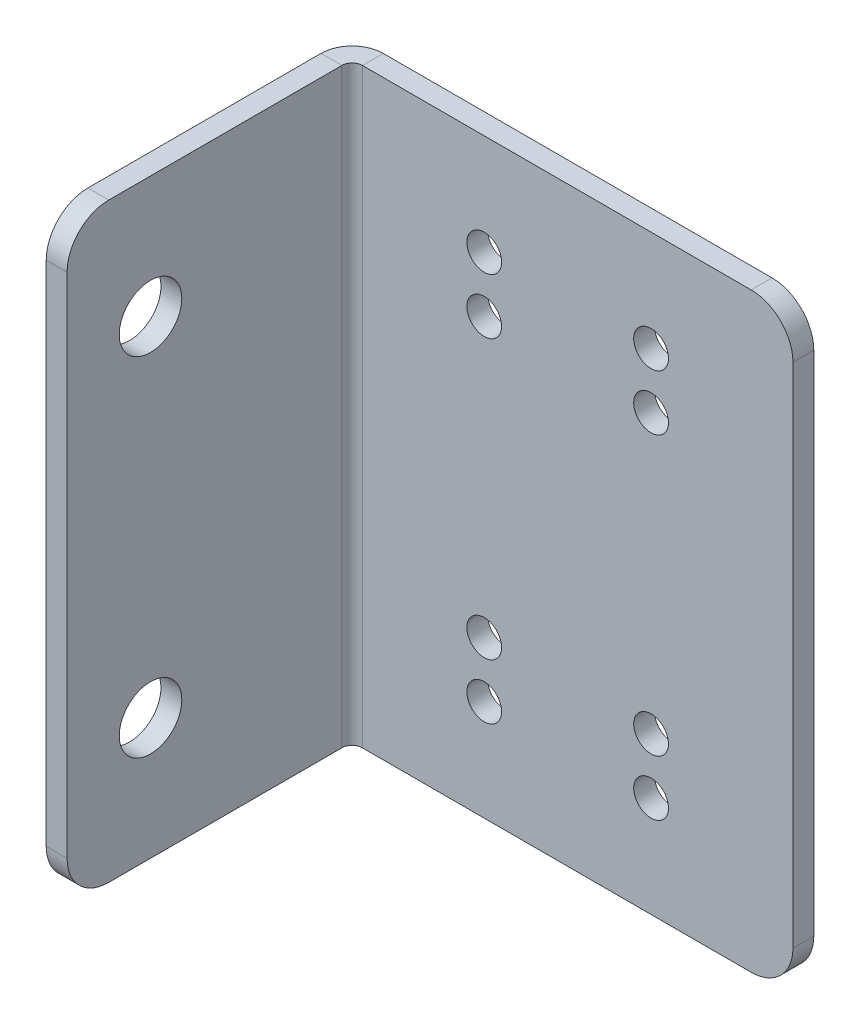
ISO-10303-21;
HEADER;
FILE_DESCRIPTION(('STEP AP214'),'2;1');
FILE_NAME('part.step','',(''),(''),'','','');
FILE_SCHEMA(('AUTOMOTIVE_DESIGN { 1 0 10303 214 1 1 1 1 }'));
ENDSEC;
DATA;
#1=APPLICATION_CONTEXT('core data for automotive mechanical design processes');
#2=APPLICATION_PROTOCOL_DEFINITION('international standard','automotive_design',2000,#1);
#3=PRODUCT_CONTEXT('',#1,'mechanical');
#4=PRODUCT('Part','Part','',(#3));
#5=PRODUCT_RELATED_PRODUCT_CATEGORY('part','',(#4));
#6=PRODUCT_DEFINITION_FORMATION('','',#4);
#7=PRODUCT_DEFINITION_CONTEXT('part definition',#1,'design');
#8=PRODUCT_DEFINITION('design','',#6,#7);
#9=PRODUCT_DEFINITION_SHAPE('','',#8);
#10=(LENGTH_UNIT() NAMED_UNIT(*) SI_UNIT(.MILLI.,.METRE.));
#11=(NAMED_UNIT(*) PLANE_ANGLE_UNIT() SI_UNIT($,.RADIAN.));
#12=(NAMED_UNIT(*) SI_UNIT($,.STERADIAN.) SOLID_ANGLE_UNIT());
#13=UNCERTAINTY_MEASURE_WITH_UNIT(LENGTH_MEASURE(1.E-05),#10,'distance_accuracy_value','');
#14=(GEOMETRIC_REPRESENTATION_CONTEXT(3) GLOBAL_UNCERTAINTY_ASSIGNED_CONTEXT((#13)) GLOBAL_UNIT_ASSIGNED_CONTEXT((#10,
#11,#12)) REPRESENTATION_CONTEXT('',''));
#15=CARTESIAN_POINT('',(0.,0.,0.));
#16=DIRECTION('',(0.,0.,1.));
#17=DIRECTION('',(1.,0.,0.));
#18=AXIS2_PLACEMENT_3D('',#15,#16,#17);
#19=CARTESIAN_POINT('',(16.6,-21.25,-1.5));
#20=DIRECTION('',(0.,-1.,0.));
#21=DIRECTION('',(1.,0.,0.));
#22=AXIS2_PLACEMENT_3D('',#19,#20,#21);
#23=PLANE('',#22);
#24=DIRECTION('',(1.,0.,0.));
#25=VECTOR('',#24,1.);
#26=CARTESIAN_POINT('',(16.6,-21.25,-1.5));
#27=LINE('',#26,#25);
#28=CARTESIAN_POINT('',(-14.3634,-21.25,-1.5));
#29=VERTEX_POINT('',#28);
#30=CARTESIAN_POINT('',(13.6,-21.25,-1.5));
#31=VERTEX_POINT('',#30);
#32=EDGE_CURVE('E219',#29,#31,#27,.T.);
#33=ORIENTED_EDGE('',*,*,#32,.T.);
#34=DIRECTION('',(0.,0.,1.));
#35=VECTOR('',#34,1.);
#36=CARTESIAN_POINT('',(13.6,-21.25,-1.5));
#37=LINE('',#36,#35);
#38=CARTESIAN_POINT('',(13.6,-21.25,0.));
#39=VERTEX_POINT('',#38);
#40=EDGE_CURVE('E247',#31,#39,#37,.T.);
#41=ORIENTED_EDGE('',*,*,#40,.T.);
#42=DIRECTION('',(1.,0.,0.));
#43=VECTOR('',#42,1.);
#44=CARTESIAN_POINT('',(16.6,-21.25,0.));
#45=LINE('',#44,#43);
#46=CARTESIAN_POINT('',(-14.3634,-21.25,0.));
#47=VERTEX_POINT('',#46);
#48=EDGE_CURVE('E216',#47,#39,#45,.T.);
#49=ORIENTED_EDGE('',*,*,#48,.F.);
#50=DIRECTION('',(0.,0.,-1.));
#51=VECTOR('',#50,1.);
#52=CARTESIAN_POINT('',(-14.3634,-21.25,0.));
#53=LINE('',#52,#51);
#54=EDGE_CURVE('E205',#47,#29,#53,.T.);
#55=ORIENTED_EDGE('',*,*,#54,.T.);
#56=EDGE_LOOP('',(#33,#41,#49,#55));
#57=FACE_BOUND('',#56,.T.);
#58=ADVANCED_FACE('F58',(#57),#23,.T.);
#59=CARTESIAN_POINT('',(0.,0.,-1.5));
#60=DIRECTION('',(0.,0.,1.));
#61=DIRECTION('',(1.,0.,0.));
#62=AXIS2_PLACEMENT_3D('',#59,#60,#61);
#63=PLANE('',#62);
#64=CARTESIAN_POINT('',(-5.59999999999984,-14.,-1.5));
#65=DIRECTION('',(0.,0.,1.));
#66=DIRECTION('',(1.,0.,0.));
#67=AXIS2_PLACEMENT_3D('',#64,#65,#66);
#68=CIRCLE('',#67,1.25);
#69=CARTESIAN_POINT('',(-4.34999999999984,-14.,-1.5));
#70=VERTEX_POINT('',#69);
#71=EDGE_CURVE('E645',#70,#70,#68,.F.);
#72=ORIENTED_EDGE('',*,*,#71,.F.);
#73=EDGE_LOOP('',(#72));
#74=FACE_BOUND('',#73,.T.);
#75=CARTESIAN_POINT('',(6.40000000000016,10.,-1.5));
#76=DIRECTION('',(0.,0.,1.));
#77=DIRECTION('',(1.,0.,0.));
#78=AXIS2_PLACEMENT_3D('',#75,#76,#77);
#79=CIRCLE('',#78,1.25);
#80=CARTESIAN_POINT('',(7.65000000000016,10.,-1.5));
#81=VERTEX_POINT('',#80);
#82=EDGE_CURVE('E650',#81,#81,#79,.F.);
#83=ORIENTED_EDGE('',*,*,#82,.F.);
#84=EDGE_LOOP('',(#83));
#85=FACE_BOUND('',#84,.T.);
#86=CARTESIAN_POINT('',(-5.59999999999985,10.,-1.5));
#87=DIRECTION('',(0.,0.,1.));
#88=DIRECTION('',(1.,0.,0.));
#89=AXIS2_PLACEMENT_3D('',#86,#87,#88);
#90=CIRCLE('',#89,1.25);
#91=CARTESIAN_POINT('',(-4.34999999999984,10.,-1.5));
#92=VERTEX_POINT('',#91);
#93=EDGE_CURVE('E653',#92,#92,#90,.F.);
#94=ORIENTED_EDGE('',*,*,#93,.F.);
#95=EDGE_LOOP('',(#94));
#96=FACE_BOUND('',#95,.T.);
#97=CARTESIAN_POINT('',(6.40000000000016,-14.,-1.5));
#98=DIRECTION('',(0.,0.,1.));
#99=DIRECTION('',(1.,0.,0.));
#100=AXIS2_PLACEMENT_3D('',#97,#98,#99);
#101=CIRCLE('',#100,1.25);
#102=CARTESIAN_POINT('',(7.65000000000016,-14.,-1.5));
#103=VERTEX_POINT('',#102);
#104=EDGE_CURVE('E656',#103,#103,#101,.F.);
#105=ORIENTED_EDGE('',*,*,#104,.F.);
#106=EDGE_LOOP('',(#105));
#107=FACE_BOUND('',#106,.T.);
#108=CARTESIAN_POINT('',(-5.59999999999984,14.,-1.5));
#109=DIRECTION('',(0.,0.,1.));
#110=DIRECTION('',(1.,0.,0.));
#111=AXIS2_PLACEMENT_3D('',#108,#109,#110);
#112=CIRCLE('',#111,1.25);
#113=CARTESIAN_POINT('',(-4.34999999999984,14.,-1.5));
#114=VERTEX_POINT('',#113);
#115=EDGE_CURVE('E202',#114,#114,#112,.T.);
#116=ORIENTED_EDGE('',*,*,#115,.T.);
#117=EDGE_LOOP('',(#116));
#118=FACE_BOUND('',#117,.T.);
#119=CARTESIAN_POINT('',(6.40000000000016,-10.,-1.5));
#120=DIRECTION('',(0.,0.,1.));
#121=DIRECTION('',(1.,0.,0.));
#122=AXIS2_PLACEMENT_3D('',#119,#120,#121);
#123=CIRCLE('',#122,1.25);
#124=CARTESIAN_POINT('',(7.65000000000016,-10.,-1.5));
#125=VERTEX_POINT('',#124);
#126=EDGE_CURVE('E617',#125,#125,#123,.T.);
#127=ORIENTED_EDGE('',*,*,#126,.T.);
#128=EDGE_LOOP('',(#127));
#129=FACE_BOUND('',#128,.T.);
#130=CARTESIAN_POINT('',(-5.59999999999985,-10.,-1.5));
#131=DIRECTION('',(0.,0.,1.));
#132=DIRECTION('',(1.,0.,0.));
#133=AXIS2_PLACEMENT_3D('',#130,#131,#132);
#134=CIRCLE('',#133,1.25);
#135=CARTESIAN_POINT('',(-4.34999999999984,-10.,-1.5));
#136=VERTEX_POINT('',#135);
#137=EDGE_CURVE('E610',#136,#136,#134,.T.);
#138=ORIENTED_EDGE('',*,*,#137,.T.);
#139=EDGE_LOOP('',(#138));
#140=FACE_BOUND('',#139,.T.);
#141=CARTESIAN_POINT('',(6.40000000000016,14.,-1.5));
#142=DIRECTION('',(0.,0.,1.));
#143=DIRECTION('',(1.,0.,0.));
#144=AXIS2_PLACEMENT_3D('',#141,#142,#143);
#145=CIRCLE('',#144,1.25);
#146=CARTESIAN_POINT('',(7.65000000000016,14.,-1.5));
#147=VERTEX_POINT('',#146);
#148=EDGE_CURVE('E607',#147,#147,#145,.T.);
#149=ORIENTED_EDGE('',*,*,#148,.T.);
#150=EDGE_LOOP('',(#149));
#151=FACE_BOUND('',#150,.T.);
#152=DIRECTION('',(0.,1.,0.));
#153=VECTOR('',#152,1.);
#154=CARTESIAN_POINT('',(16.6,-21.25,-1.5));
#155=LINE('',#154,#153);
#156=CARTESIAN_POINT('',(16.6,-18.25,-1.5));
#157=VERTEX_POINT('',#156);
#158=CARTESIAN_POINT('',(16.6,18.25,-1.5));
#159=VERTEX_POINT('',#158);
#160=EDGE_CURVE('E222',#157,#159,#155,.T.);
#161=ORIENTED_EDGE('',*,*,#160,.F.);
#162=CARTESIAN_POINT('',(13.6,-18.25,-1.5));
#163=DIRECTION('',(0.,0.,1.));
#164=DIRECTION('',(1.,0.,0.));
#165=AXIS2_PLACEMENT_3D('',#162,#163,#164);
#166=CIRCLE('',#165,3.);
#167=EDGE_CURVE('E260',#157,#31,#166,.F.);
#168=ORIENTED_EDGE('',*,*,#167,.T.);
#169=ORIENTED_EDGE('',*,*,#32,.F.);
#170=DIRECTION('',(0.,-1.,0.));
#171=VECTOR('',#170,1.);
#172=CARTESIAN_POINT('',(-14.3634,-21.25,-1.5));
#173=LINE('',#172,#171);
#174=CARTESIAN_POINT('',(-14.3634,21.25,-1.5));
#175=VERTEX_POINT('',#174);
#176=EDGE_CURVE('E157',#29,#175,#173,.F.);
#177=ORIENTED_EDGE('',*,*,#176,.T.);
#178=DIRECTION('',(-1.,0.,0.));
#179=VECTOR('',#178,1.);
#180=CARTESIAN_POINT('',(16.6,21.25,-1.5));
#181=LINE('',#180,#179);
#182=CARTESIAN_POINT('',(13.6,21.25,-1.5));
#183=VERTEX_POINT('',#182);
#184=EDGE_CURVE('E225',#183,#175,#181,.T.);
#185=ORIENTED_EDGE('',*,*,#184,.F.);
#186=CARTESIAN_POINT('',(13.6,18.25,-1.5));
#187=DIRECTION('',(0.,0.,1.));
#188=DIRECTION('',(1.,0.,0.));
#189=AXIS2_PLACEMENT_3D('',#186,#187,#188);
#190=CIRCLE('',#189,3.);
#191=EDGE_CURVE('E79',#183,#159,#190,.F.);
#192=ORIENTED_EDGE('',*,*,#191,.T.);
#193=EDGE_LOOP('',(#161,#168,#169,#177,#185,#192));
#194=FACE_BOUND('',#193,.T.);
#195=ADVANCED_FACE('F262',(#74,#85,#96,#107,#118,#129,#140,#151,#194),#63,.F.);
#196=CARTESIAN_POINT('',(0.,0.,0.));
#197=DIRECTION('',(0.,0.,1.));
#198=DIRECTION('',(1.,0.,0.));
#199=AXIS2_PLACEMENT_3D('',#196,#197,#198);
#200=PLANE('',#199);
#201=CARTESIAN_POINT('',(-5.59999999999984,-14.,0.));
#202=DIRECTION('',(0.,0.,-1.));
#203=DIRECTION('',(1.,0.,0.));
#204=AXIS2_PLACEMENT_3D('',#201,#202,#203);
#205=CIRCLE('',#204,1.25);
#206=CARTESIAN_POINT('',(-4.34999999999984,-14.,0.));
#207=VERTEX_POINT('',#206);
#208=EDGE_CURVE('E579',#207,#207,#205,.T.);
#209=ORIENTED_EDGE('',*,*,#208,.T.);
#210=EDGE_LOOP('',(#209));
#211=FACE_BOUND('',#210,.T.);
#212=CARTESIAN_POINT('',(6.40000000000016,10.,0.));
#213=DIRECTION('',(0.,0.,-1.));
#214=DIRECTION('',(1.,0.,0.));
#215=AXIS2_PLACEMENT_3D('',#212,#213,#214);
#216=CIRCLE('',#215,1.25);
#217=CARTESIAN_POINT('',(7.65000000000016,10.,0.));
#218=VERTEX_POINT('',#217);
#219=EDGE_CURVE('E583',#218,#218,#216,.T.);
#220=ORIENTED_EDGE('',*,*,#219,.T.);
#221=EDGE_LOOP('',(#220));
#222=FACE_BOUND('',#221,.T.);
#223=CARTESIAN_POINT('',(-5.59999999999985,10.,0.));
#224=DIRECTION('',(0.,0.,-1.));
#225=DIRECTION('',(1.,0.,0.));
#226=AXIS2_PLACEMENT_3D('',#223,#224,#225);
#227=CIRCLE('',#226,1.25);
#228=CARTESIAN_POINT('',(-4.34999999999984,10.,0.));
#229=VERTEX_POINT('',#228);
#230=EDGE_CURVE('E587',#229,#229,#227,.T.);
#231=ORIENTED_EDGE('',*,*,#230,.T.);
#232=EDGE_LOOP('',(#231));
#233=FACE_BOUND('',#232,.T.);
#234=CARTESIAN_POINT('',(6.40000000000016,-14.,0.));
#235=DIRECTION('',(0.,0.,-1.));
#236=DIRECTION('',(1.,0.,0.));
#237=AXIS2_PLACEMENT_3D('',#234,#235,#236);
#238=CIRCLE('',#237,1.25);
#239=CARTESIAN_POINT('',(7.65000000000016,-14.,0.));
#240=VERTEX_POINT('',#239);
#241=EDGE_CURVE('E591',#240,#240,#238,.T.);
#242=ORIENTED_EDGE('',*,*,#241,.T.);
#243=EDGE_LOOP('',(#242));
#244=FACE_BOUND('',#243,.T.);
#245=CARTESIAN_POINT('',(-5.59999999999984,14.,0.));
#246=DIRECTION('',(0.,0.,1.));
#247=DIRECTION('',(1.,0.,0.));
#248=AXIS2_PLACEMENT_3D('',#245,#246,#247);
#249=CIRCLE('',#248,1.25);
#250=CARTESIAN_POINT('',(-4.34999999999984,14.,0.));
#251=VERTEX_POINT('',#250);
#252=EDGE_CURVE('E595',#251,#251,#249,.T.);
#253=ORIENTED_EDGE('',*,*,#252,.F.);
#254=EDGE_LOOP('',(#253));
#255=FACE_BOUND('',#254,.T.);
#256=CARTESIAN_POINT('',(6.40000000000016,-10.,0.));
#257=DIRECTION('',(0.,0.,1.));
#258=DIRECTION('',(1.,0.,0.));
#259=AXIS2_PLACEMENT_3D('',#256,#257,#258);
#260=CIRCLE('',#259,1.25);
#261=CARTESIAN_POINT('',(7.65000000000016,-10.,0.));
#262=VERTEX_POINT('',#261);
#263=EDGE_CURVE('E599',#262,#262,#260,.T.);
#264=ORIENTED_EDGE('',*,*,#263,.F.);
#265=EDGE_LOOP('',(#264));
#266=FACE_BOUND('',#265,.T.);
#267=CARTESIAN_POINT('',(-5.59999999999985,-10.,0.));
#268=DIRECTION('',(0.,0.,1.));
#269=DIRECTION('',(1.,0.,0.));
#270=AXIS2_PLACEMENT_3D('',#267,#268,#269);
#271=CIRCLE('',#270,1.25);
#272=CARTESIAN_POINT('',(-4.34999999999984,-10.,0.));
#273=VERTEX_POINT('',#272);
#274=EDGE_CURVE('E603',#273,#273,#271,.T.);
#275=ORIENTED_EDGE('',*,*,#274,.F.);
#276=EDGE_LOOP('',(#275));
#277=FACE_BOUND('',#276,.T.);
#278=CARTESIAN_POINT('',(6.40000000000016,14.,0.));
#279=DIRECTION('',(0.,0.,1.));
#280=DIRECTION('',(1.,0.,0.));
#281=AXIS2_PLACEMENT_3D('',#278,#279,#280);
#282=CIRCLE('',#281,1.25);
#283=CARTESIAN_POINT('',(7.65000000000016,14.,0.));
#284=VERTEX_POINT('',#283);
#285=EDGE_CURVE('E606',#284,#284,#282,.T.);
#286=ORIENTED_EDGE('',*,*,#285,.F.);
#287=EDGE_LOOP('',(#286));
#288=FACE_BOUND('',#287,.T.);
#289=ORIENTED_EDGE('',*,*,#48,.T.);
#290=CARTESIAN_POINT('',(13.6,-18.25,0.));
#291=DIRECTION('',(0.,0.,1.));
#292=DIRECTION('',(1.,0.,0.));
#293=AXIS2_PLACEMENT_3D('',#290,#291,#292);
#294=CIRCLE('',#293,3.);
#295=CARTESIAN_POINT('',(16.6,-18.25,0.));
#296=VERTEX_POINT('',#295);
#297=EDGE_CURVE('E252',#39,#296,#294,.T.);
#298=ORIENTED_EDGE('',*,*,#297,.T.);
#299=DIRECTION('',(0.,1.,0.));
#300=VECTOR('',#299,1.);
#301=CARTESIAN_POINT('',(16.6,-21.25,0.));
#302=LINE('',#301,#300);
#303=CARTESIAN_POINT('',(16.6,18.25,0.));
#304=VERTEX_POINT('',#303);
#305=EDGE_CURVE('E230',#296,#304,#302,.T.);
#306=ORIENTED_EDGE('',*,*,#305,.T.);
#307=CARTESIAN_POINT('',(13.6,18.25,0.));
#308=DIRECTION('',(0.,0.,1.));
#309=DIRECTION('',(1.,0.,0.));
#310=AXIS2_PLACEMENT_3D('',#307,#308,#309);
#311=CIRCLE('',#310,3.);
#312=CARTESIAN_POINT('',(13.6,21.25,0.));
#313=VERTEX_POINT('',#312);
#314=EDGE_CURVE('E250',#304,#313,#311,.T.);
#315=ORIENTED_EDGE('',*,*,#314,.T.);
#316=DIRECTION('',(-1.,0.,0.));
#317=VECTOR('',#316,1.);
#318=CARTESIAN_POINT('',(16.6,21.25,0.));
#319=LINE('',#318,#317);
#320=CARTESIAN_POINT('',(-14.3634,21.25,0.));
#321=VERTEX_POINT('',#320);
#322=EDGE_CURVE('E223',#313,#321,#319,.T.);
#323=ORIENTED_EDGE('',*,*,#322,.T.);
#324=DIRECTION('',(0.,-1.,0.));
#325=VECTOR('',#324,1.);
#326=CARTESIAN_POINT('',(-14.3634,-21.25,0.));
#327=LINE('',#326,#325);
#328=EDGE_CURVE('E209',#47,#321,#327,.F.);
#329=ORIENTED_EDGE('',*,*,#328,.F.);
#330=EDGE_LOOP('',(#289,#298,#306,#315,#323,#329));
#331=FACE_BOUND('',#330,.T.);
#332=ADVANCED_FACE('F271',(#211,#222,#233,#244,#255,#266,#277,#288,#331),#200,.T.);
#333=CARTESIAN_POINT('',(16.6,21.25,-1.5));
#334=DIRECTION('',(0.,1.,0.));
#335=DIRECTION('',(0.,0.,1.));
#336=AXIS2_PLACEMENT_3D('',#333,#334,#335);
#337=PLANE('',#336);
#338=ORIENTED_EDGE('',*,*,#322,.F.);
#339=DIRECTION('',(0.,0.,1.));
#340=VECTOR('',#339,1.);
#341=CARTESIAN_POINT('',(13.6,21.25,-1.5));
#342=LINE('',#341,#340);
#343=EDGE_CURVE('E66',#313,#183,#342,.F.);
#344=ORIENTED_EDGE('',*,*,#343,.T.);
#345=ORIENTED_EDGE('',*,*,#184,.T.);
#346=DIRECTION('',(0.,0.,-1.));
#347=VECTOR('',#346,1.);
#348=CARTESIAN_POINT('',(-14.3634,21.25,0.));
#349=LINE('',#348,#347);
#350=EDGE_CURVE('E213',#321,#175,#349,.T.);
#351=ORIENTED_EDGE('',*,*,#350,.F.);
#352=EDGE_LOOP('',(#338,#344,#345,#351));
#353=FACE_BOUND('',#352,.T.);
#354=ADVANCED_FACE('F278',(#353),#337,.T.);
#355=CARTESIAN_POINT('',(16.6,-21.25,-1.5));
#356=DIRECTION('',(1.,0.,0.));
#357=DIRECTION('',(0.,0.,-1.));
#358=AXIS2_PLACEMENT_3D('',#355,#356,#357);
#359=PLANE('',#358);
#360=ORIENTED_EDGE('',*,*,#305,.F.);
#361=DIRECTION('',(0.,0.,1.));
#362=VECTOR('',#361,1.);
#363=CARTESIAN_POINT('',(16.6,-18.25,-1.5));
#364=LINE('',#363,#362);
#365=EDGE_CURVE('E257',#296,#157,#364,.F.);
#366=ORIENTED_EDGE('',*,*,#365,.T.);
#367=ORIENTED_EDGE('',*,*,#160,.T.);
#368=DIRECTION('',(0.,0.,1.));
#369=VECTOR('',#368,1.);
#370=CARTESIAN_POINT('',(16.6,18.25,-1.5));
#371=LINE('',#370,#369);
#372=EDGE_CURVE('E254',#159,#304,#371,.T.);
#373=ORIENTED_EDGE('',*,*,#372,.T.);
#374=EDGE_LOOP('',(#360,#366,#367,#373));
#375=FACE_BOUND('',#374,.T.);
#376=ADVANCED_FACE('F273',(#375),#359,.T.);
#377=CARTESIAN_POINT('',(-14.3634,21.25,0.7366));
#378=DIRECTION('',(0.,1.,0.));
#379=DIRECTION('',(0.,0.,1.));
#380=AXIS2_PLACEMENT_3D('',#377,#378,#379);
#381=PLANE('',#380);
#382=DIRECTION('',(1.,0.,0.));
#383=VECTOR('',#382,1.);
#384=CARTESIAN_POINT('',(-16.6,21.25,0.736599999999992));
#385=LINE('',#384,#383);
#386=CARTESIAN_POINT('',(-15.1,21.25,0.736599999999997));
#387=VERTEX_POINT('',#386);
#388=CARTESIAN_POINT('',(-16.6,21.25,0.736599999999992));
#389=VERTEX_POINT('',#388);
#390=EDGE_CURVE('E199',#387,#389,#385,.F.);
#391=ORIENTED_EDGE('',*,*,#390,.F.);
#392=CARTESIAN_POINT('',(-14.3634,21.25,0.7366));
#393=DIRECTION('',(0.,-1.,0.));
#394=DIRECTION('',(0.,0.,-1.));
#395=AXIS2_PLACEMENT_3D('',#392,#393,#394);
#396=CIRCLE('',#395,0.7366);
#397=EDGE_CURVE('E160',#321,#387,#396,.F.);
#398=ORIENTED_EDGE('',*,*,#397,.F.);
#399=ORIENTED_EDGE('',*,*,#350,.T.);
#400=CARTESIAN_POINT('',(-14.3634,21.25,0.7366));
#401=DIRECTION('',(0.,-1.,0.));
#402=DIRECTION('',(0.,0.,-1.));
#403=AXIS2_PLACEMENT_3D('',#400,#401,#402);
#404=CIRCLE('',#403,2.2366);
#405=EDGE_CURVE('E204',#175,#389,#404,.F.);
#406=ORIENTED_EDGE('',*,*,#405,.T.);
#407=EDGE_LOOP('',(#391,#398,#399,#406));
#408=FACE_BOUND('',#407,.T.);
#409=ADVANCED_FACE('F285',(#408),#381,.T.);
#410=CARTESIAN_POINT('',(-14.3634,-21.25,0.7366));
#411=DIRECTION('',(0.,1.,0.));
#412=DIRECTION('',(0.,0.,1.));
#413=AXIS2_PLACEMENT_3D('',#410,#411,#412);
#414=PLANE('',#413);
#415=CARTESIAN_POINT('',(-14.3634,-21.25,0.7366));
#416=DIRECTION('',(0.,-1.,0.));
#417=DIRECTION('',(0.,0.,-1.));
#418=AXIS2_PLACEMENT_3D('',#415,#416,#417);
#419=CIRCLE('',#418,0.7366);
#420=CARTESIAN_POINT('',(-15.1,-21.25,0.736599999999997));
#421=VERTEX_POINT('',#420);
#422=EDGE_CURVE('E167',#421,#47,#419,.T.);
#423=ORIENTED_EDGE('',*,*,#422,.F.);
#424=DIRECTION('',(1.,0.,0.));
#425=VECTOR('',#424,1.);
#426=CARTESIAN_POINT('',(-15.1,-21.25,0.736599999999997));
#427=LINE('',#426,#425);
#428=CARTESIAN_POINT('',(-16.6,-21.25,0.736599999999992));
#429=VERTEX_POINT('',#428);
#430=EDGE_CURVE('E164',#421,#429,#427,.F.);
#431=ORIENTED_EDGE('',*,*,#430,.T.);
#432=CARTESIAN_POINT('',(-14.3634,-21.25,0.7366));
#433=DIRECTION('',(0.,-1.,0.));
#434=DIRECTION('',(0.,0.,-1.));
#435=AXIS2_PLACEMENT_3D('',#432,#433,#434);
#436=CIRCLE('',#435,2.2366);
#437=EDGE_CURVE('E149',#429,#29,#436,.T.);
#438=ORIENTED_EDGE('',*,*,#437,.T.);
#439=ORIENTED_EDGE('',*,*,#54,.F.);
#440=EDGE_LOOP('',(#423,#431,#438,#439));
#441=FACE_BOUND('',#440,.T.);
#442=ADVANCED_FACE('F165',(#441),#414,.F.);
#443=CARTESIAN_POINT('',(-14.3634,-21.25,0.7366));
#444=DIRECTION('',(0.,-1.,0.));
#445=DIRECTION('',(-1.,0.,0.));
#446=AXIS2_PLACEMENT_3D('',#443,#444,#445);
#447=CYLINDRICAL_SURFACE('',#446,2.2366);
#448=ORIENTED_EDGE('',*,*,#176,.F.);
#449=ORIENTED_EDGE('',*,*,#437,.F.);
#450=DIRECTION('',(0.,-1.,0.));
#451=VECTOR('',#450,1.);
#452=CARTESIAN_POINT('',(-16.6,21.25,0.736599999999992));
#453=LINE('',#452,#451);
#454=EDGE_CURVE('E154',#429,#389,#453,.F.);
#455=ORIENTED_EDGE('',*,*,#454,.T.);
#456=ORIENTED_EDGE('',*,*,#405,.F.);
#457=EDGE_LOOP('',(#448,#449,#455,#456));
#458=FACE_BOUND('',#457,.T.);
#459=ADVANCED_FACE('F151',(#458),#447,.T.);
#460=CARTESIAN_POINT('',(-14.3634,-21.25,0.7366));
#461=DIRECTION('',(0.,-1.,0.));
#462=DIRECTION('',(-1.,0.,0.));
#463=AXIS2_PLACEMENT_3D('',#460,#461,#462);
#464=CYLINDRICAL_SURFACE('',#463,0.7366);
#465=ORIENTED_EDGE('',*,*,#328,.T.);
#466=ORIENTED_EDGE('',*,*,#397,.T.);
#467=DIRECTION('',(0.,-1.,0.));
#468=VECTOR('',#467,1.);
#469=CARTESIAN_POINT('',(-15.1,21.25,0.736599999999997));
#470=LINE('',#469,#468);
#471=EDGE_CURVE('E172',#387,#421,#470,.T.);
#472=ORIENTED_EDGE('',*,*,#471,.T.);
#473=ORIENTED_EDGE('',*,*,#422,.T.);
#474=EDGE_LOOP('',(#465,#466,#472,#473));
#475=FACE_BOUND('',#474,.T.);
#476=ADVANCED_FACE('F282',(#475),#464,.F.);
#477=CARTESIAN_POINT('',(-16.6000000000001,-21.25,20.5));
#478=DIRECTION('',(0.,1.,0.));
#479=DIRECTION('',(0.,0.,1.));
#480=AXIS2_PLACEMENT_3D('',#477,#478,#479);
#481=PLANE('',#480);
#482=DIRECTION('',(0.,0.,-1.));
#483=VECTOR('',#482,1.);
#484=CARTESIAN_POINT('',(-15.1000000000001,-21.25,20.5));
#485=LINE('',#484,#483);
#486=CARTESIAN_POINT('',(-15.1000000000001,-21.25,17.5));
#487=VERTEX_POINT('',#486);
#488=EDGE_CURVE('E181',#421,#487,#485,.F.);
#489=ORIENTED_EDGE('',*,*,#488,.T.);
#490=DIRECTION('',(1.,0.,0.));
#491=VECTOR('',#490,1.);
#492=CARTESIAN_POINT('',(-16.6000000000001,-21.25,17.5));
#493=LINE('',#492,#491);
#494=CARTESIAN_POINT('',(-16.6000000000001,-21.25,17.5));
#495=VERTEX_POINT('',#494);
#496=EDGE_CURVE('E185',#487,#495,#493,.F.);
#497=ORIENTED_EDGE('',*,*,#496,.T.);
#498=DIRECTION('',(0.,0.,1.));
#499=VECTOR('',#498,1.);
#500=CARTESIAN_POINT('',(-16.6,-21.25,0.));
#501=LINE('',#500,#499);
#502=EDGE_CURVE('E177',#429,#495,#501,.T.);
#503=ORIENTED_EDGE('',*,*,#502,.F.);
#504=ORIENTED_EDGE('',*,*,#430,.F.);
#505=EDGE_LOOP('',(#489,#497,#503,#504));
#506=FACE_BOUND('',#505,.T.);
#507=ADVANCED_FACE('F183',(#506),#481,.F.);
#508=CARTESIAN_POINT('',(-16.6,21.25,0.));
#509=DIRECTION('',(0.,-1.,0.));
#510=DIRECTION('',(0.,0.,-1.));
#511=AXIS2_PLACEMENT_3D('',#508,#509,#510);
#512=PLANE('',#511);
#513=DIRECTION('',(0.,0.,-1.));
#514=VECTOR('',#513,1.);
#515=CARTESIAN_POINT('',(-16.6,21.25,0.));
#516=LINE('',#515,#514);
#517=CARTESIAN_POINT('',(-16.6000000000001,21.25,17.5));
#518=VERTEX_POINT('',#517);
#519=EDGE_CURVE('E180',#518,#389,#516,.T.);
#520=ORIENTED_EDGE('',*,*,#519,.F.);
#521=DIRECTION('',(1.,0.,0.));
#522=VECTOR('',#521,1.);
#523=CARTESIAN_POINT('',(-16.6000000000001,21.25,17.5));
#524=LINE('',#523,#522);
#525=CARTESIAN_POINT('',(-15.1000000000001,21.25,17.5));
#526=VERTEX_POINT('',#525);
#527=EDGE_CURVE('E13',#518,#526,#524,.T.);
#528=ORIENTED_EDGE('',*,*,#527,.T.);
#529=DIRECTION('',(0.,0.,1.));
#530=VECTOR('',#529,1.);
#531=CARTESIAN_POINT('',(-15.1,21.25,0.));
#532=LINE('',#531,#530);
#533=EDGE_CURVE('E187',#526,#387,#532,.F.);
#534=ORIENTED_EDGE('',*,*,#533,.T.);
#535=ORIENTED_EDGE('',*,*,#390,.T.);
#536=EDGE_LOOP('',(#520,#528,#534,#535));
#537=FACE_BOUND('',#536,.T.);
#538=ADVANCED_FACE('F287',(#537),#512,.F.);
#539=CARTESIAN_POINT('',(-16.6,0.,0.));
#540=DIRECTION('',(1.,0.,0.));
#541=DIRECTION('',(0.,0.,-1.));
#542=AXIS2_PLACEMENT_3D('',#539,#540,#541);
#543=PLANE('',#542);
#544=CARTESIAN_POINT('',(-16.6000000000001,12.5,14.5));
#545=DIRECTION('',(1.,0.,0.));
#546=DIRECTION('',(0.,0.,-1.));
#547=AXIS2_PLACEMENT_3D('',#544,#545,#546);
#548=CIRCLE('',#547,2.25);
#549=CARTESIAN_POINT('',(-16.6,12.5,12.25));
#550=VERTEX_POINT('',#549);
#551=EDGE_CURVE('E635',#550,#550,#548,.T.);
#552=ORIENTED_EDGE('',*,*,#551,.T.);
#553=EDGE_LOOP('',(#552));
#554=FACE_BOUND('',#553,.T.);
#555=CARTESIAN_POINT('',(-16.6000000000001,-12.5,14.5));
#556=DIRECTION('',(1.,0.,0.));
#557=DIRECTION('',(0.,0.,-1.));
#558=AXIS2_PLACEMENT_3D('',#555,#556,#557);
#559=CIRCLE('',#558,2.25);
#560=CARTESIAN_POINT('',(-16.6,-12.5,12.25));
#561=VERTEX_POINT('',#560);
#562=EDGE_CURVE('E638',#561,#561,#559,.T.);
#563=ORIENTED_EDGE('',*,*,#562,.T.);
#564=EDGE_LOOP('',(#563));
#565=FACE_BOUND('',#564,.T.);
#566=ORIENTED_EDGE('',*,*,#502,.T.);
#567=CARTESIAN_POINT('',(-16.6000000000001,-18.25,17.5));
#568=DIRECTION('',(1.,0.,0.));
#569=DIRECTION('',(0.,0.,-1.));
#570=AXIS2_PLACEMENT_3D('',#567,#568,#569);
#571=CIRCLE('',#570,3.);
#572=CARTESIAN_POINT('',(-16.6000000000001,-18.25,20.5));
#573=VERTEX_POINT('',#572);
#574=EDGE_CURVE('E245',#495,#573,#571,.F.);
#575=ORIENTED_EDGE('',*,*,#574,.T.);
#576=DIRECTION('',(0.,1.,0.));
#577=VECTOR('',#576,1.);
#578=CARTESIAN_POINT('',(-16.6000000000001,0.,20.5));
#579=LINE('',#578,#577);
#580=CARTESIAN_POINT('',(-16.6000000000001,18.25,20.5));
#581=VERTEX_POINT('',#580);
#582=EDGE_CURVE('E186',#573,#581,#579,.T.);
#583=ORIENTED_EDGE('',*,*,#582,.T.);
#584=CARTESIAN_POINT('',(-16.6000000000001,18.25,17.5));
#585=DIRECTION('',(1.,0.,0.));
#586=DIRECTION('',(0.,0.,-1.));
#587=AXIS2_PLACEMENT_3D('',#584,#585,#586);
#588=CIRCLE('',#587,3.);
#589=EDGE_CURVE('E243',#581,#518,#588,.F.);
#590=ORIENTED_EDGE('',*,*,#589,.T.);
#591=ORIENTED_EDGE('',*,*,#519,.T.);
#592=ORIENTED_EDGE('',*,*,#454,.F.);
#593=EDGE_LOOP('',(#566,#575,#583,#590,#591,#592));
#594=FACE_BOUND('',#593,.T.);
#595=ADVANCED_FACE('F176',(#554,#565,#594),#543,.F.);
#596=CARTESIAN_POINT('',(-15.1,0.,0.));
#597=DIRECTION('',(1.,0.,0.));
#598=DIRECTION('',(0.,0.,-1.));
#599=AXIS2_PLACEMENT_3D('',#596,#597,#598);
#600=PLANE('',#599);
#601=CARTESIAN_POINT('',(-15.1000000000001,12.5,14.5));
#602=DIRECTION('',(1.,0.,0.));
#603=DIRECTION('',(0.,0.,-1.));
#604=AXIS2_PLACEMENT_3D('',#601,#602,#603);
#605=CIRCLE('',#604,2.25);
#606=CARTESIAN_POINT('',(-15.1,12.5,12.25));
#607=VERTEX_POINT('',#606);
#608=EDGE_CURVE('E641',#607,#607,#605,.T.);
#609=ORIENTED_EDGE('',*,*,#608,.F.);
#610=EDGE_LOOP('',(#609));
#611=FACE_BOUND('',#610,.T.);
#612=CARTESIAN_POINT('',(-15.1000000000001,-12.5,14.5));
#613=DIRECTION('',(1.,0.,0.));
#614=DIRECTION('',(0.,0.,-1.));
#615=AXIS2_PLACEMENT_3D('',#612,#613,#614);
#616=CIRCLE('',#615,2.25);
#617=CARTESIAN_POINT('',(-15.1,-12.5,12.25));
#618=VERTEX_POINT('',#617);
#619=EDGE_CURVE('E642',#618,#618,#616,.T.);
#620=ORIENTED_EDGE('',*,*,#619,.F.);
#621=EDGE_LOOP('',(#620));
#622=FACE_BOUND('',#621,.T.);
#623=DIRECTION('',(0.,-1.,0.));
#624=VECTOR('',#623,1.);
#625=CARTESIAN_POINT('',(-15.1000000000001,21.25,20.5));
#626=LINE('',#625,#624);
#627=CARTESIAN_POINT('',(-15.1000000000001,-18.25,20.5));
#628=VERTEX_POINT('',#627);
#629=CARTESIAN_POINT('',(-15.1000000000001,18.25,20.5));
#630=VERTEX_POINT('',#629);
#631=EDGE_CURVE('E191',#628,#630,#626,.F.);
#632=ORIENTED_EDGE('',*,*,#631,.F.);
#633=CARTESIAN_POINT('',(-15.1000000000001,-18.25,17.5));
#634=DIRECTION('',(1.,0.,0.));
#635=DIRECTION('',(0.,0.,-1.));
#636=AXIS2_PLACEMENT_3D('',#633,#634,#635);
#637=CIRCLE('',#636,3.);
#638=EDGE_CURVE('E240',#628,#487,#637,.T.);
#639=ORIENTED_EDGE('',*,*,#638,.T.);
#640=ORIENTED_EDGE('',*,*,#488,.F.);
#641=ORIENTED_EDGE('',*,*,#471,.F.);
#642=ORIENTED_EDGE('',*,*,#533,.F.);
#643=CARTESIAN_POINT('',(-15.1000000000001,18.25,17.5));
#644=DIRECTION('',(1.,0.,0.));
#645=DIRECTION('',(0.,0.,-1.));
#646=AXIS2_PLACEMENT_3D('',#643,#644,#645);
#647=CIRCLE('',#646,3.);
#648=EDGE_CURVE('E238',#526,#630,#647,.T.);
#649=ORIENTED_EDGE('',*,*,#648,.T.);
#650=EDGE_LOOP('',(#632,#639,#640,#641,#642,#649));
#651=FACE_BOUND('',#650,.T.);
#652=ADVANCED_FACE('F292',(#611,#622,#651),#600,.T.);
#653=CARTESIAN_POINT('',(-16.6000000000001,21.25,20.5));
#654=DIRECTION('',(0.,0.,-1.));
#655=DIRECTION('',(-1.,0.,0.));
#656=AXIS2_PLACEMENT_3D('',#653,#654,#655);
#657=PLANE('',#656);
#658=ORIENTED_EDGE('',*,*,#582,.F.);
#659=DIRECTION('',(1.,0.,0.));
#660=VECTOR('',#659,1.);
#661=CARTESIAN_POINT('',(-16.6000000000001,-18.25,20.5));
#662=LINE('',#661,#660);
#663=EDGE_CURVE('E235',#573,#628,#662,.T.);
#664=ORIENTED_EDGE('',*,*,#663,.T.);
#665=ORIENTED_EDGE('',*,*,#631,.T.);
#666=DIRECTION('',(1.,0.,0.));
#667=VECTOR('',#666,1.);
#668=CARTESIAN_POINT('',(-16.6000000000001,18.25,20.5));
#669=LINE('',#668,#667);
#670=EDGE_CURVE('E227',#630,#581,#669,.F.);
#671=ORIENTED_EDGE('',*,*,#670,.T.);
#672=EDGE_LOOP('',(#658,#664,#665,#671));
#673=FACE_BOUND('',#672,.T.);
#674=ADVANCED_FACE('F299',(#673),#657,.F.);
#675=CARTESIAN_POINT('',(6.40000000000016,14.,-10.));
#676=DIRECTION('',(0.,0.,1.));
#677=DIRECTION('',(1.,0.,0.));
#678=AXIS2_PLACEMENT_3D('',#675,#676,#677);
#679=CYLINDRICAL_SURFACE('',#678,1.25);
#680=ORIENTED_EDGE('',*,*,#285,.T.);
#681=EDGE_LOOP('',(#680));
#682=FACE_BOUND('',#681,.T.);
#683=ORIENTED_EDGE('',*,*,#148,.F.);
#684=EDGE_LOOP('',(#683));
#685=FACE_BOUND('',#684,.T.);
#686=ADVANCED_FACE('F421',(#682,#685),#679,.F.);
#687=CARTESIAN_POINT('',(-5.59999999999985,-10.,-10.));
#688=DIRECTION('',(0.,0.,1.));
#689=DIRECTION('',(1.,0.,0.));
#690=AXIS2_PLACEMENT_3D('',#687,#688,#689);
#691=CYLINDRICAL_SURFACE('',#690,1.25);
#692=ORIENTED_EDGE('',*,*,#274,.T.);
#693=EDGE_LOOP('',(#692));
#694=FACE_BOUND('',#693,.T.);
#695=ORIENTED_EDGE('',*,*,#137,.F.);
#696=EDGE_LOOP('',(#695));
#697=FACE_BOUND('',#696,.T.);
#698=ADVANCED_FACE('F412',(#694,#697),#691,.F.);
#699=CARTESIAN_POINT('',(6.40000000000016,-10.,-10.));
#700=DIRECTION('',(0.,0.,1.));
#701=DIRECTION('',(1.,0.,0.));
#702=AXIS2_PLACEMENT_3D('',#699,#700,#701);
#703=CYLINDRICAL_SURFACE('',#702,1.25);
#704=ORIENTED_EDGE('',*,*,#263,.T.);
#705=EDGE_LOOP('',(#704));
#706=FACE_BOUND('',#705,.T.);
#707=ORIENTED_EDGE('',*,*,#126,.F.);
#708=EDGE_LOOP('',(#707));
#709=FACE_BOUND('',#708,.T.);
#710=ADVANCED_FACE('F403',(#706,#709),#703,.F.);
#711=CARTESIAN_POINT('',(-5.59999999999984,14.,-10.));
#712=DIRECTION('',(0.,0.,1.));
#713=DIRECTION('',(1.,0.,0.));
#714=AXIS2_PLACEMENT_3D('',#711,#712,#713);
#715=CYLINDRICAL_SURFACE('',#714,1.25);
#716=ORIENTED_EDGE('',*,*,#252,.T.);
#717=EDGE_LOOP('',(#716));
#718=FACE_BOUND('',#717,.T.);
#719=ORIENTED_EDGE('',*,*,#115,.F.);
#720=EDGE_LOOP('',(#719));
#721=FACE_BOUND('',#720,.T.);
#722=ADVANCED_FACE('F394',(#718,#721),#715,.F.);
#723=CARTESIAN_POINT('',(-25.1000000000001,-12.5,14.5));
#724=DIRECTION('',(1.,0.,0.));
#725=DIRECTION('',(0.,0.,-1.));
#726=AXIS2_PLACEMENT_3D('',#723,#724,#725);
#727=CYLINDRICAL_SURFACE('',#726,2.25);
#728=ORIENTED_EDGE('',*,*,#619,.T.);
#729=EDGE_LOOP('',(#728));
#730=FACE_BOUND('',#729,.T.);
#731=ORIENTED_EDGE('',*,*,#562,.F.);
#732=EDGE_LOOP('',(#731));
#733=FACE_BOUND('',#732,.T.);
#734=ADVANCED_FACE('F385',(#730,#733),#727,.F.);
#735=CARTESIAN_POINT('',(-25.1000000000001,12.5,14.5));
#736=DIRECTION('',(1.,0.,0.));
#737=DIRECTION('',(0.,0.,-1.));
#738=AXIS2_PLACEMENT_3D('',#735,#736,#737);
#739=CYLINDRICAL_SURFACE('',#738,2.25);
#740=ORIENTED_EDGE('',*,*,#608,.T.);
#741=EDGE_LOOP('',(#740));
#742=FACE_BOUND('',#741,.T.);
#743=ORIENTED_EDGE('',*,*,#551,.F.);
#744=EDGE_LOOP('',(#743));
#745=FACE_BOUND('',#744,.T.);
#746=ADVANCED_FACE('F376',(#742,#745),#739,.F.);
#747=CARTESIAN_POINT('',(6.40000000000016,-14.,-10.));
#748=DIRECTION('',(0.,0.,1.));
#749=DIRECTION('',(1.,0.,0.));
#750=AXIS2_PLACEMENT_3D('',#747,#748,#749);
#751=CYLINDRICAL_SURFACE('',#750,1.25);
#752=ORIENTED_EDGE('',*,*,#241,.F.);
#753=EDGE_LOOP('',(#752));
#754=FACE_BOUND('',#753,.T.);
#755=ORIENTED_EDGE('',*,*,#104,.T.);
#756=EDGE_LOOP('',(#755));
#757=FACE_BOUND('',#756,.T.);
#758=ADVANCED_FACE('F367',(#754,#757),#751,.F.);
#759=CARTESIAN_POINT('',(-5.59999999999985,10.,-10.));
#760=DIRECTION('',(0.,0.,1.));
#761=DIRECTION('',(1.,0.,0.));
#762=AXIS2_PLACEMENT_3D('',#759,#760,#761);
#763=CYLINDRICAL_SURFACE('',#762,1.25);
#764=ORIENTED_EDGE('',*,*,#230,.F.);
#765=EDGE_LOOP('',(#764));
#766=FACE_BOUND('',#765,.T.);
#767=ORIENTED_EDGE('',*,*,#93,.T.);
#768=EDGE_LOOP('',(#767));
#769=FACE_BOUND('',#768,.T.);
#770=ADVANCED_FACE('F358',(#766,#769),#763,.F.);
#771=CARTESIAN_POINT('',(6.40000000000016,10.,-10.));
#772=DIRECTION('',(0.,0.,1.));
#773=DIRECTION('',(1.,0.,0.));
#774=AXIS2_PLACEMENT_3D('',#771,#772,#773);
#775=CYLINDRICAL_SURFACE('',#774,1.25);
#776=ORIENTED_EDGE('',*,*,#219,.F.);
#777=EDGE_LOOP('',(#776));
#778=FACE_BOUND('',#777,.T.);
#779=ORIENTED_EDGE('',*,*,#82,.T.);
#780=EDGE_LOOP('',(#779));
#781=FACE_BOUND('',#780,.T.);
#782=ADVANCED_FACE('F349',(#778,#781),#775,.F.);
#783=CARTESIAN_POINT('',(-5.59999999999984,-14.,-10.));
#784=DIRECTION('',(0.,0.,1.));
#785=DIRECTION('',(1.,0.,0.));
#786=AXIS2_PLACEMENT_3D('',#783,#784,#785);
#787=CYLINDRICAL_SURFACE('',#786,1.25);
#788=ORIENTED_EDGE('',*,*,#208,.F.);
#789=EDGE_LOOP('',(#788));
#790=FACE_BOUND('',#789,.T.);
#791=ORIENTED_EDGE('',*,*,#71,.T.);
#792=EDGE_LOOP('',(#791));
#793=FACE_BOUND('',#792,.T.);
#794=ADVANCED_FACE('F318',(#790,#793),#787,.F.);
#795=CARTESIAN_POINT('',(-16.6000000000001,-18.25,17.5));
#796=DIRECTION('',(1.,0.,0.));
#797=DIRECTION('',(0.,0.,-1.));
#798=AXIS2_PLACEMENT_3D('',#795,#796,#797);
#799=CYLINDRICAL_SURFACE('',#798,3.);
#800=ORIENTED_EDGE('',*,*,#574,.F.);
#801=ORIENTED_EDGE('',*,*,#496,.F.);
#802=ORIENTED_EDGE('',*,*,#638,.F.);
#803=ORIENTED_EDGE('',*,*,#663,.F.);
#804=EDGE_LOOP('',(#800,#801,#802,#803));
#805=FACE_BOUND('',#804,.T.);
#806=ADVANCED_FACE('F294',(#805),#799,.T.);
#807=CARTESIAN_POINT('',(13.6,-18.25,-1.5));
#808=DIRECTION('',(0.,0.,1.));
#809=DIRECTION('',(1.,0.,0.));
#810=AXIS2_PLACEMENT_3D('',#807,#808,#809);
#811=CYLINDRICAL_SURFACE('',#810,3.);
#812=ORIENTED_EDGE('',*,*,#167,.F.);
#813=ORIENTED_EDGE('',*,*,#365,.F.);
#814=ORIENTED_EDGE('',*,*,#297,.F.);
#815=ORIENTED_EDGE('',*,*,#40,.F.);
#816=EDGE_LOOP('',(#812,#813,#814,#815));
#817=FACE_BOUND('',#816,.T.);
#818=ADVANCED_FACE('F268',(#817),#811,.T.);
#819=CARTESIAN_POINT('',(13.6,18.25,-1.5));
#820=DIRECTION('',(0.,0.,1.));
#821=DIRECTION('',(1.,0.,0.));
#822=AXIS2_PLACEMENT_3D('',#819,#820,#821);
#823=CYLINDRICAL_SURFACE('',#822,3.);
#824=ORIENTED_EDGE('',*,*,#191,.F.);
#825=ORIENTED_EDGE('',*,*,#343,.F.);
#826=ORIENTED_EDGE('',*,*,#314,.F.);
#827=ORIENTED_EDGE('',*,*,#372,.F.);
#828=EDGE_LOOP('',(#824,#825,#826,#827));
#829=FACE_BOUND('',#828,.T.);
#830=ADVANCED_FACE('F276',(#829),#823,.T.);
#831=CARTESIAN_POINT('',(-16.6000000000001,18.25,17.5));
#832=DIRECTION('',(1.,0.,0.));
#833=DIRECTION('',(0.,0.,-1.));
#834=AXIS2_PLACEMENT_3D('',#831,#832,#833);
#835=CYLINDRICAL_SURFACE('',#834,3.);
#836=ORIENTED_EDGE('',*,*,#589,.F.);
#837=ORIENTED_EDGE('',*,*,#670,.F.);
#838=ORIENTED_EDGE('',*,*,#648,.F.);
#839=ORIENTED_EDGE('',*,*,#527,.F.);
#840=EDGE_LOOP('',(#836,#837,#838,#839));
#841=FACE_BOUND('',#840,.T.);
#842=ADVANCED_FACE('F60',(#841),#835,.T.);
#843=CLOSED_SHELL('',(#58,#195,#332,#354,#376,#409,#442,#459,#476,#507,#538,#595,#652,#674,#686,
#698,#710,#722,#734,#746,#758,#770,#782,#794,#806,#818,#830,#842));
#844=MANIFOLD_SOLID_BREP('B2',#843);
#845=ADVANCED_BREP_SHAPE_REPRESENTATION('',(#18,#844),#14);
#846=SHAPE_DEFINITION_REPRESENTATION(#9,#845);
ENDSEC;
END-ISO-10303-21;
